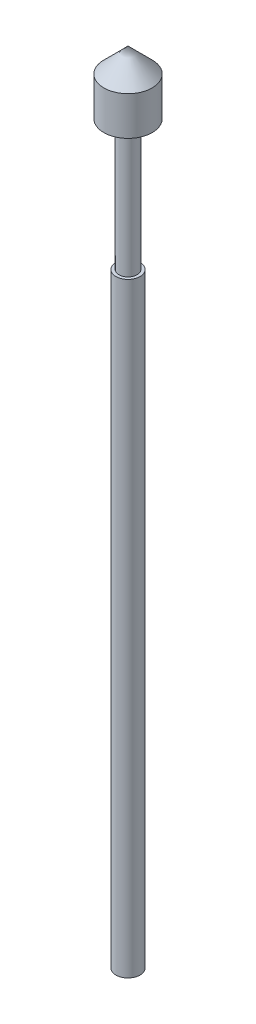
ISO-10303-21;
HEADER;
FILE_DESCRIPTION(('STEP AP214'),'2;1');
FILE_NAME('part.step','',(''),(''),'','','');
FILE_SCHEMA(('AUTOMOTIVE_DESIGN { 1 0 10303 214 1 1 1 1 }'));
ENDSEC;
DATA;
#1=APPLICATION_CONTEXT('core data for automotive mechanical design processes');
#2=APPLICATION_PROTOCOL_DEFINITION('international standard','automotive_design',2000,#1);
#3=PRODUCT_CONTEXT('',#1,'mechanical');
#4=PRODUCT('Part','Part','',(#3));
#5=PRODUCT_RELATED_PRODUCT_CATEGORY('part','',(#4));
#6=PRODUCT_DEFINITION_FORMATION('','',#4);
#7=PRODUCT_DEFINITION_CONTEXT('part definition',#1,'design');
#8=PRODUCT_DEFINITION('design','',#6,#7);
#9=PRODUCT_DEFINITION_SHAPE('','',#8);
#10=(LENGTH_UNIT() NAMED_UNIT(*) SI_UNIT(.MILLI.,.METRE.));
#11=(NAMED_UNIT(*) PLANE_ANGLE_UNIT() SI_UNIT($,.RADIAN.));
#12=(NAMED_UNIT(*) SI_UNIT($,.STERADIAN.) SOLID_ANGLE_UNIT());
#13=UNCERTAINTY_MEASURE_WITH_UNIT(LENGTH_MEASURE(1.E-05),#10,'distance_accuracy_value','');
#14=(GEOMETRIC_REPRESENTATION_CONTEXT(3) GLOBAL_UNCERTAINTY_ASSIGNED_CONTEXT((#13)) GLOBAL_UNIT_ASSIGNED_CONTEXT((#10,
#11,#12)) REPRESENTATION_CONTEXT('',''));
#15=CARTESIAN_POINT('',(0.,0.,0.));
#16=DIRECTION('',(0.,0.,1.));
#17=DIRECTION('',(1.,0.,0.));
#18=AXIS2_PLACEMENT_3D('',#15,#16,#17);
#19=CARTESIAN_POINT('',(0.500000000000002,0.,0.));
#20=DIRECTION('',(0.,-1.,0.));
#21=DIRECTION('',(0.,0.,-1.));
#22=AXIS2_PLACEMENT_3D('',#19,#20,#21);
#23=PLANE('',#22);
#24=CARTESIAN_POINT('',(0.,0.,0.));
#25=DIRECTION('',(0.,-1.,0.));
#26=DIRECTION('',(0.,0.,-1.));
#27=AXIS2_PLACEMENT_3D('',#24,#25,#26);
#28=CIRCLE('',#27,0.500000000000002);
#29=CARTESIAN_POINT('',(0.,0.,-0.500000000000002));
#30=VERTEX_POINT('',#29);
#31=EDGE_CURVE('E63',#30,#30,#28,.T.);
#32=ORIENTED_EDGE('',*,*,#31,.T.);
#33=EDGE_LOOP('',(#32));
#34=FACE_BOUND('',#33,.T.);
#35=ADVANCED_FACE('F31',(#34),#23,.T.);
#36=CARTESIAN_POINT('',(0.,32.,0.));
#37=DIRECTION('',(0.,-1.,0.));
#38=DIRECTION('',(0.,0.,-1.));
#39=AXIS2_PLACEMENT_3D('',#36,#37,#38);
#40=CONICAL_SURFACE('',#39,1.,0.785398163397445);
#41=CARTESIAN_POINT('',(0.,33.,0.));
#42=VERTEX_POINT('',#41);
#43=VERTEX_LOOP('',#42);
#44=FACE_BOUND('',#43,.T.);
#45=CARTESIAN_POINT('',(0.,32.,0.));
#46=DIRECTION('',(0.,-1.,0.));
#47=DIRECTION('',(0.,0.,-1.));
#48=AXIS2_PLACEMENT_3D('',#45,#46,#47);
#49=CIRCLE('',#48,1.);
#50=CARTESIAN_POINT('',(0.,32.,-1.));
#51=VERTEX_POINT('',#50);
#52=EDGE_CURVE('E11',#51,#51,#49,.T.);
#53=ORIENTED_EDGE('',*,*,#52,.F.);
#54=EDGE_LOOP('',(#53));
#55=FACE_BOUND('',#54,.T.);
#56=ADVANCED_FACE('F40',(#44,#55),#40,.T.);
#57=CARTESIAN_POINT('',(0.,0.,0.));
#58=DIRECTION('',(0.,-1.,0.));
#59=DIRECTION('',(0.,0.,-1.));
#60=AXIS2_PLACEMENT_3D('',#57,#58,#59);
#61=CYLINDRICAL_SURFACE('',#60,1.);
#62=ORIENTED_EDGE('',*,*,#52,.T.);
#63=EDGE_LOOP('',(#62));
#64=FACE_BOUND('',#63,.T.);
#65=CARTESIAN_POINT('',(0.,30.4,0.));
#66=DIRECTION('',(0.,-1.,0.));
#67=DIRECTION('',(0.,0.,-1.));
#68=AXIS2_PLACEMENT_3D('',#65,#66,#67);
#69=CIRCLE('',#68,1.);
#70=CARTESIAN_POINT('',(0.,30.4,-1.));
#71=VERTEX_POINT('',#70);
#72=EDGE_CURVE('E37',#71,#71,#69,.T.);
#73=ORIENTED_EDGE('',*,*,#72,.F.);
#74=EDGE_LOOP('',(#73));
#75=FACE_BOUND('',#74,.T.);
#76=ADVANCED_FACE('F43',(#64,#75),#61,.T.);
#77=CARTESIAN_POINT('',(1.,30.4,0.));
#78=DIRECTION('',(0.,-1.,0.));
#79=DIRECTION('',(0.,0.,-1.));
#80=AXIS2_PLACEMENT_3D('',#77,#78,#79);
#81=PLANE('',#80);
#82=ORIENTED_EDGE('',*,*,#72,.T.);
#83=EDGE_LOOP('',(#82));
#84=FACE_BOUND('',#83,.T.);
#85=CARTESIAN_POINT('',(0.,30.4,0.));
#86=DIRECTION('',(0.,-1.,0.));
#87=DIRECTION('',(0.,0.,-1.));
#88=AXIS2_PLACEMENT_3D('',#85,#86,#87);
#89=CIRCLE('',#88,0.375);
#90=CARTESIAN_POINT('',(0.,30.4,-0.375));
#91=VERTEX_POINT('',#90);
#92=EDGE_CURVE('E53',#91,#91,#89,.T.);
#93=ORIENTED_EDGE('',*,*,#92,.F.);
#94=EDGE_LOOP('',(#93));
#95=FACE_BOUND('',#94,.T.);
#96=ADVANCED_FACE('F48',(#84,#95),#81,.T.);
#97=CARTESIAN_POINT('',(0.,0.,0.));
#98=DIRECTION('',(0.,-1.,0.));
#99=DIRECTION('',(0.,0.,-1.));
#100=AXIS2_PLACEMENT_3D('',#97,#98,#99);
#101=CYLINDRICAL_SURFACE('',#100,0.375);
#102=ORIENTED_EDGE('',*,*,#92,.T.);
#103=EDGE_LOOP('',(#102));
#104=FACE_BOUND('',#103,.T.);
#105=CARTESIAN_POINT('',(0.,25.,0.));
#106=DIRECTION('',(0.,-1.,0.));
#107=DIRECTION('',(0.,0.,-1.));
#108=AXIS2_PLACEMENT_3D('',#105,#106,#107);
#109=CIRCLE('',#108,0.375);
#110=CARTESIAN_POINT('',(0.,25.,-0.375));
#111=VERTEX_POINT('',#110);
#112=EDGE_CURVE('E55',#111,#111,#109,.T.);
#113=ORIENTED_EDGE('',*,*,#112,.F.);
#114=EDGE_LOOP('',(#113));
#115=FACE_BOUND('',#114,.T.);
#116=ADVANCED_FACE('F76',(#104,#115),#101,.T.);
#117=CARTESIAN_POINT('',(0.375,25.,0.));
#118=DIRECTION('',(0.,1.,0.));
#119=DIRECTION('',(0.,0.,1.));
#120=AXIS2_PLACEMENT_3D('',#117,#118,#119);
#121=PLANE('',#120);
#122=ORIENTED_EDGE('',*,*,#112,.T.);
#123=EDGE_LOOP('',(#122));
#124=FACE_BOUND('',#123,.T.);
#125=CARTESIAN_POINT('',(0.,25.,0.));
#126=DIRECTION('',(0.,-1.,0.));
#127=DIRECTION('',(0.,0.,-1.));
#128=AXIS2_PLACEMENT_3D('',#125,#126,#127);
#129=CIRCLE('',#128,0.499999999999999);
#130=CARTESIAN_POINT('',(0.,25.,-0.499999999999999));
#131=VERTEX_POINT('',#130);
#132=EDGE_CURVE('E60',#131,#131,#129,.T.);
#133=ORIENTED_EDGE('',*,*,#132,.F.);
#134=EDGE_LOOP('',(#133));
#135=FACE_BOUND('',#134,.T.);
#136=ADVANCED_FACE('F70',(#124,#135),#121,.T.);
#137=CARTESIAN_POINT('',(0.,0.,0.));
#138=DIRECTION('',(0.,-1.,0.));
#139=DIRECTION('',(0.,0.,-1.));
#140=AXIS2_PLACEMENT_3D('',#137,#138,#139);
#141=CYLINDRICAL_SURFACE('',#140,0.500000000000001);
#142=ORIENTED_EDGE('',*,*,#132,.T.);
#143=EDGE_LOOP('',(#142));
#144=FACE_BOUND('',#143,.T.);
#145=ORIENTED_EDGE('',*,*,#31,.F.);
#146=EDGE_LOOP('',(#145));
#147=FACE_BOUND('',#146,.T.);
#148=ADVANCED_FACE('F68',(#144,#147),#141,.T.);
#149=CLOSED_SHELL('',(#35,#56,#76,#96,#116,#136,#148));
#150=MANIFOLD_SOLID_BREP('B2',#149);
#151=ADVANCED_BREP_SHAPE_REPRESENTATION('',(#18,#150),#14);
#152=SHAPE_DEFINITION_REPRESENTATION(#9,#151);
ENDSEC;
END-ISO-10303-21;
